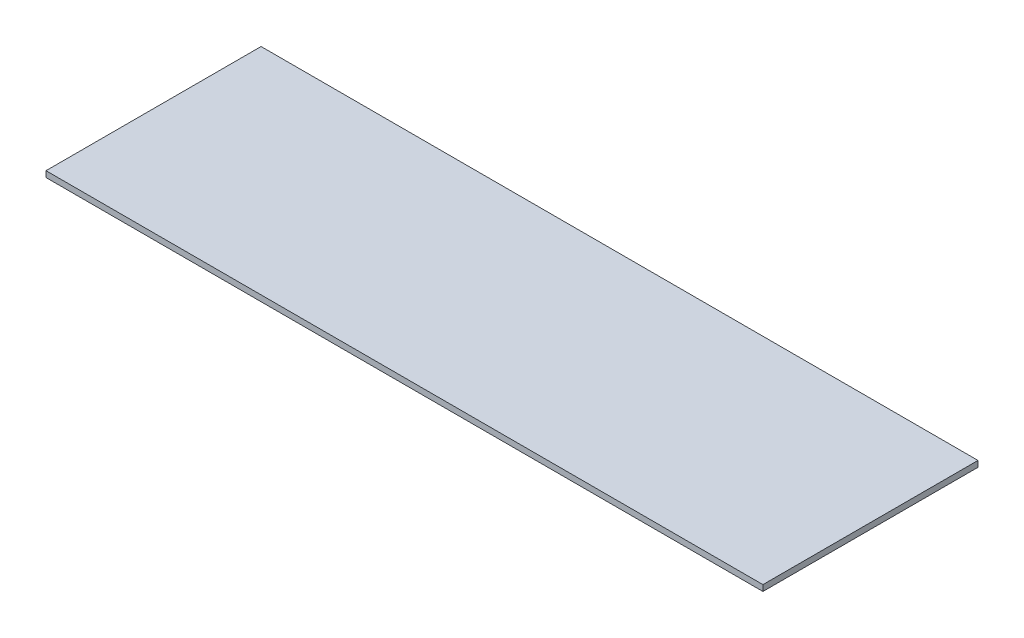
ISO-10303-21;
HEADER;
FILE_DESCRIPTION(('STEP AP214'),'2;1');
FILE_NAME('part.step','',(''),(''),'','','');
FILE_SCHEMA(('AUTOMOTIVE_DESIGN { 1 0 10303 214 1 1 1 1 }'));
ENDSEC;
DATA;
#1=APPLICATION_CONTEXT('core data for automotive mechanical design processes');
#2=APPLICATION_PROTOCOL_DEFINITION('international standard','automotive_design',2000,#1);
#3=PRODUCT_CONTEXT('',#1,'mechanical');
#4=PRODUCT('Part','Part','',(#3));
#5=PRODUCT_RELATED_PRODUCT_CATEGORY('part','',(#4));
#6=PRODUCT_DEFINITION_FORMATION('','',#4);
#7=PRODUCT_DEFINITION_CONTEXT('part definition',#1,'design');
#8=PRODUCT_DEFINITION('design','',#6,#7);
#9=PRODUCT_DEFINITION_SHAPE('','',#8);
#10=(LENGTH_UNIT() NAMED_UNIT(*) SI_UNIT(.MILLI.,.METRE.));
#11=(NAMED_UNIT(*) PLANE_ANGLE_UNIT() SI_UNIT($,.RADIAN.));
#12=(NAMED_UNIT(*) SI_UNIT($,.STERADIAN.) SOLID_ANGLE_UNIT());
#13=UNCERTAINTY_MEASURE_WITH_UNIT(LENGTH_MEASURE(1.E-05),#10,'distance_accuracy_value','');
#14=(GEOMETRIC_REPRESENTATION_CONTEXT(3) GLOBAL_UNCERTAINTY_ASSIGNED_CONTEXT((#13)) GLOBAL_UNIT_ASSIGNED_CONTEXT((#10,
#11,#12)) REPRESENTATION_CONTEXT('',''));
#15=CARTESIAN_POINT('',(0.,0.,0.));
#16=DIRECTION('',(0.,0.,1.));
#17=DIRECTION('',(1.,0.,0.));
#18=AXIS2_PLACEMENT_3D('',#15,#16,#17);
#19=CARTESIAN_POINT('',(600.,10.,-180.));
#20=DIRECTION('',(-1.,0.,0.));
#21=DIRECTION('',(0.,0.,1.));
#22=AXIS2_PLACEMENT_3D('',#19,#20,#21);
#23=PLANE('',#22);
#24=DIRECTION('',(0.,0.,-1.));
#25=VECTOR('',#24,1.);
#26=CARTESIAN_POINT('',(600.,0.,-180.));
#27=LINE('',#26,#25);
#28=CARTESIAN_POINT('',(600.,0.,180.));
#29=VERTEX_POINT('',#28);
#30=CARTESIAN_POINT('',(600.,0.,-180.));
#31=VERTEX_POINT('',#30);
#32=EDGE_CURVE('E99',#29,#31,#27,.T.);
#33=ORIENTED_EDGE('',*,*,#32,.T.);
#34=DIRECTION('',(0.,-1.,0.));
#35=VECTOR('',#34,1.);
#36=CARTESIAN_POINT('',(600.,10.,-180.));
#37=LINE('',#36,#35);
#38=CARTESIAN_POINT('',(600.,10.,-180.));
#39=VERTEX_POINT('',#38);
#40=EDGE_CURVE('E11',#39,#31,#37,.T.);
#41=ORIENTED_EDGE('',*,*,#40,.F.);
#42=DIRECTION('',(0.,0.,-1.));
#43=VECTOR('',#42,1.);
#44=CARTESIAN_POINT('',(600.,10.,-180.));
#45=LINE('',#44,#43);
#46=CARTESIAN_POINT('',(600.,10.,180.));
#47=VERTEX_POINT('',#46);
#48=EDGE_CURVE('E87',#47,#39,#45,.T.);
#49=ORIENTED_EDGE('',*,*,#48,.F.);
#50=DIRECTION('',(0.,-1.,0.));
#51=VECTOR('',#50,1.);
#52=CARTESIAN_POINT('',(600.,10.,180.));
#53=LINE('',#52,#51);
#54=EDGE_CURVE('E95',#47,#29,#53,.T.);
#55=ORIENTED_EDGE('',*,*,#54,.T.);
#56=EDGE_LOOP('',(#33,#41,#49,#55));
#57=FACE_BOUND('',#56,.T.);
#58=ADVANCED_FACE('F36',(#57),#23,.F.);
#59=CARTESIAN_POINT('',(-600.,10.,-180.));
#60=DIRECTION('',(0.,0.,1.));
#61=DIRECTION('',(1.,0.,0.));
#62=AXIS2_PLACEMENT_3D('',#59,#60,#61);
#63=PLANE('',#62);
#64=DIRECTION('',(-1.,0.,0.));
#65=VECTOR('',#64,1.);
#66=CARTESIAN_POINT('',(-600.,0.,-180.));
#67=LINE('',#66,#65);
#68=CARTESIAN_POINT('',(-600.,0.,-180.));
#69=VERTEX_POINT('',#68);
#70=EDGE_CURVE('E91',#31,#69,#67,.T.);
#71=ORIENTED_EDGE('',*,*,#70,.T.);
#72=DIRECTION('',(0.,-1.,0.));
#73=VECTOR('',#72,1.);
#74=CARTESIAN_POINT('',(-600.,10.,-180.));
#75=LINE('',#74,#73);
#76=CARTESIAN_POINT('',(-600.,10.,-180.));
#77=VERTEX_POINT('',#76);
#78=EDGE_CURVE('E44',#77,#69,#75,.T.);
#79=ORIENTED_EDGE('',*,*,#78,.F.);
#80=DIRECTION('',(-1.,0.,0.));
#81=VECTOR('',#80,1.);
#82=CARTESIAN_POINT('',(-600.,10.,-180.));
#83=LINE('',#82,#81);
#84=EDGE_CURVE('E82',#39,#77,#83,.T.);
#85=ORIENTED_EDGE('',*,*,#84,.F.);
#86=ORIENTED_EDGE('',*,*,#40,.T.);
#87=EDGE_LOOP('',(#71,#79,#85,#86));
#88=FACE_BOUND('',#87,.T.);
#89=ADVANCED_FACE('F90',(#88),#63,.F.);
#90=CARTESIAN_POINT('',(-600.,10.,-180.));
#91=DIRECTION('',(1.,0.,0.));
#92=DIRECTION('',(0.,0.,-1.));
#93=AXIS2_PLACEMENT_3D('',#90,#91,#92);
#94=PLANE('',#93);
#95=DIRECTION('',(0.,0.,1.));
#96=VECTOR('',#95,1.);
#97=CARTESIAN_POINT('',(-600.,0.,-180.));
#98=LINE('',#97,#96);
#99=CARTESIAN_POINT('',(-600.,0.,180.));
#100=VERTEX_POINT('',#99);
#101=EDGE_CURVE('E69',#69,#100,#98,.T.);
#102=ORIENTED_EDGE('',*,*,#101,.T.);
#103=DIRECTION('',(0.,-1.,0.));
#104=VECTOR('',#103,1.);
#105=CARTESIAN_POINT('',(-600.,10.,180.));
#106=LINE('',#105,#104);
#107=CARTESIAN_POINT('',(-600.,10.,180.));
#108=VERTEX_POINT('',#107);
#109=EDGE_CURVE('E92',#108,#100,#106,.T.);
#110=ORIENTED_EDGE('',*,*,#109,.F.);
#111=DIRECTION('',(0.,0.,1.));
#112=VECTOR('',#111,1.);
#113=CARTESIAN_POINT('',(-600.,10.,-180.));
#114=LINE('',#113,#112);
#115=EDGE_CURVE('E85',#77,#108,#114,.T.);
#116=ORIENTED_EDGE('',*,*,#115,.F.);
#117=ORIENTED_EDGE('',*,*,#78,.T.);
#118=EDGE_LOOP('',(#102,#110,#116,#117));
#119=FACE_BOUND('',#118,.T.);
#120=ADVANCED_FACE('F93',(#119),#94,.F.);
#121=CARTESIAN_POINT('',(-600.,10.,180.));
#122=DIRECTION('',(0.,0.,-1.));
#123=DIRECTION('',(-1.,0.,0.));
#124=AXIS2_PLACEMENT_3D('',#121,#122,#123);
#125=PLANE('',#124);
#126=DIRECTION('',(1.,0.,0.));
#127=VECTOR('',#126,1.);
#128=CARTESIAN_POINT('',(-600.,0.,180.));
#129=LINE('',#128,#127);
#130=EDGE_CURVE('E75',#100,#29,#129,.T.);
#131=ORIENTED_EDGE('',*,*,#130,.T.);
#132=ORIENTED_EDGE('',*,*,#54,.F.);
#133=DIRECTION('',(1.,0.,0.));
#134=VECTOR('',#133,1.);
#135=CARTESIAN_POINT('',(-600.,10.,180.));
#136=LINE('',#135,#134);
#137=EDGE_CURVE('E52',#108,#47,#136,.T.);
#138=ORIENTED_EDGE('',*,*,#137,.F.);
#139=ORIENTED_EDGE('',*,*,#109,.T.);
#140=EDGE_LOOP('',(#131,#132,#138,#139));
#141=FACE_BOUND('',#140,.T.);
#142=ADVANCED_FACE('F106',(#141),#125,.F.);
#143=CARTESIAN_POINT('',(0.,10.,0.));
#144=DIRECTION('',(0.,1.,0.));
#145=DIRECTION('',(0.,0.,1.));
#146=AXIS2_PLACEMENT_3D('',#143,#144,#145);
#147=PLANE('',#146);
#148=ORIENTED_EDGE('',*,*,#48,.T.);
#149=ORIENTED_EDGE('',*,*,#84,.T.);
#150=ORIENTED_EDGE('',*,*,#115,.T.);
#151=ORIENTED_EDGE('',*,*,#137,.T.);
#152=EDGE_LOOP('',(#148,#149,#150,#151));
#153=FACE_BOUND('',#152,.T.);
#154=ADVANCED_FACE('F83',(#153),#147,.T.);
#155=CARTESIAN_POINT('',(0.,0.,0.));
#156=DIRECTION('',(0.,1.,0.));
#157=DIRECTION('',(0.,0.,1.));
#158=AXIS2_PLACEMENT_3D('',#155,#156,#157);
#159=PLANE('',#158);
#160=ORIENTED_EDGE('',*,*,#32,.F.);
#161=ORIENTED_EDGE('',*,*,#130,.F.);
#162=ORIENTED_EDGE('',*,*,#101,.F.);
#163=ORIENTED_EDGE('',*,*,#70,.F.);
#164=EDGE_LOOP('',(#160,#161,#162,#163));
#165=FACE_BOUND('',#164,.T.);
#166=ADVANCED_FACE('F109',(#165),#159,.F.);
#167=CLOSED_SHELL('',(#58,#89,#120,#142,#154,#166));
#168=MANIFOLD_SOLID_BREP('B2',#167);
#169=ADVANCED_BREP_SHAPE_REPRESENTATION('',(#18,#168),#14);
#170=SHAPE_DEFINITION_REPRESENTATION(#9,#169);
ENDSEC;
END-ISO-10303-21;
